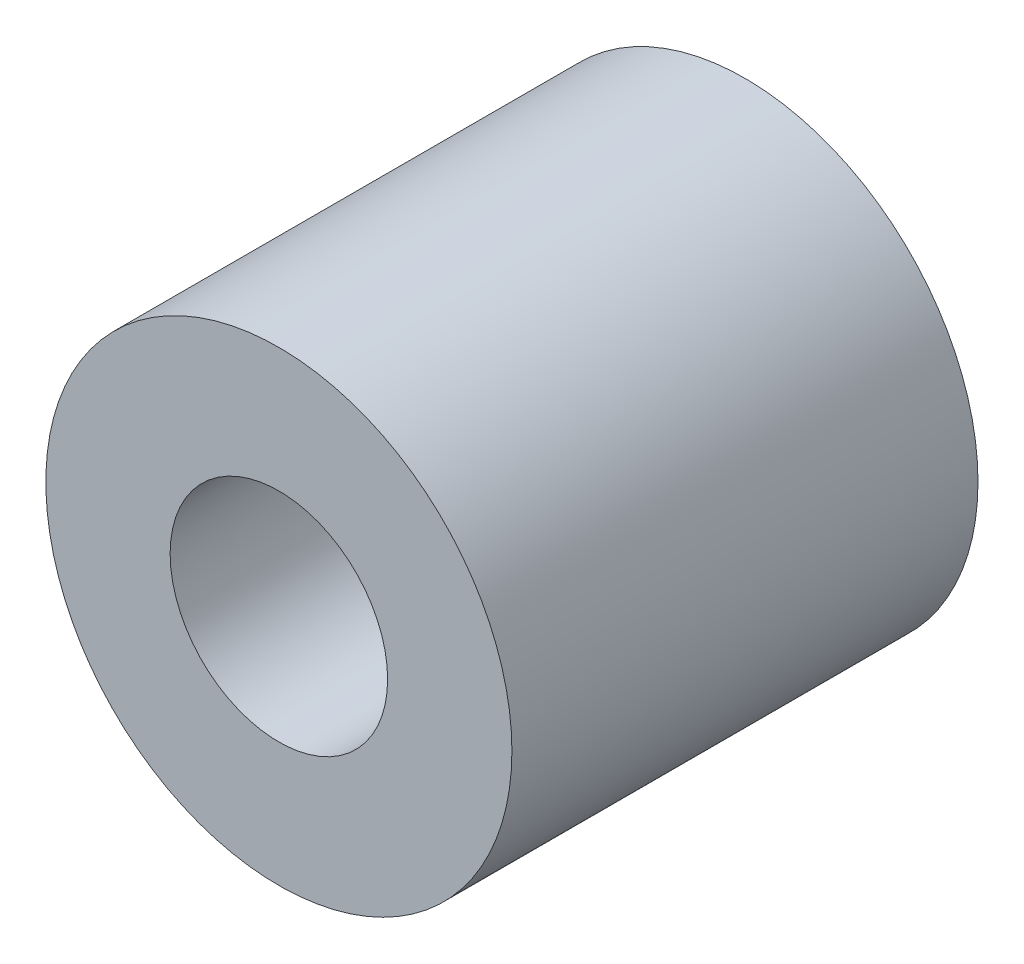
ISO-10303-21;
HEADER;
FILE_DESCRIPTION(('STEP AP214'),'2;1');
FILE_NAME('part.step','',(''),(''),'','','');
FILE_SCHEMA(('AUTOMOTIVE_DESIGN { 1 0 10303 214 1 1 1 1 }'));
ENDSEC;
DATA;
#1=APPLICATION_CONTEXT('core data for automotive mechanical design processes');
#2=APPLICATION_PROTOCOL_DEFINITION('international standard','automotive_design',2000,#1);
#3=PRODUCT_CONTEXT('',#1,'mechanical');
#4=PRODUCT('Part','Part','',(#3));
#5=PRODUCT_RELATED_PRODUCT_CATEGORY('part','',(#4));
#6=PRODUCT_DEFINITION_FORMATION('','',#4);
#7=PRODUCT_DEFINITION_CONTEXT('part definition',#1,'design');
#8=PRODUCT_DEFINITION('design','',#6,#7);
#9=PRODUCT_DEFINITION_SHAPE('','',#8);
#10=(LENGTH_UNIT() NAMED_UNIT(*) SI_UNIT(.MILLI.,.METRE.));
#11=(NAMED_UNIT(*) PLANE_ANGLE_UNIT() SI_UNIT($,.RADIAN.));
#12=(NAMED_UNIT(*) SI_UNIT($,.STERADIAN.) SOLID_ANGLE_UNIT());
#13=UNCERTAINTY_MEASURE_WITH_UNIT(LENGTH_MEASURE(1.E-05),#10,'distance_accuracy_value','');
#14=(GEOMETRIC_REPRESENTATION_CONTEXT(3) GLOBAL_UNCERTAINTY_ASSIGNED_CONTEXT((#13)) GLOBAL_UNIT_ASSIGNED_CONTEXT((#10,
#11,#12)) REPRESENTATION_CONTEXT('',''));
#15=CARTESIAN_POINT('',(0.,0.,0.));
#16=DIRECTION('',(0.,0.,1.));
#17=DIRECTION('',(1.,0.,0.));
#18=AXIS2_PLACEMENT_3D('',#15,#16,#17);
#19=CARTESIAN_POINT('',(-94.9999999999997,-24.9999999999986,-10.0000000000004));
#20=DIRECTION('',(0.,0.,1.));
#21=DIRECTION('',(1.,0.,0.));
#22=AXIS2_PLACEMENT_3D('',#19,#20,#21);
#23=PLANE('',#22);
#24=CARTESIAN_POINT('',(-94.9999999999997,-24.9999999999986,-10.0000000000004));
#25=DIRECTION('',(0.,0.,1.));
#26=DIRECTION('',(1.,0.,0.));
#27=AXIS2_PLACEMENT_3D('',#24,#25,#26);
#28=CIRCLE('',#27,15.);
#29=CARTESIAN_POINT('',(-79.9999999999997,-24.9999999999986,-10.0000000000004));
#30=VERTEX_POINT('',#29);
#31=EDGE_CURVE('E10',#30,#30,#28,.T.);
#32=ORIENTED_EDGE('',*,*,#31,.T.);
#33=EDGE_LOOP('',(#32));
#34=FACE_BOUND('',#33,.T.);
#35=CARTESIAN_POINT('',(-94.9999999999997,-24.9999999999986,-10.0000000000004));
#36=DIRECTION('',(0.,0.,1.));
#37=DIRECTION('',(1.,0.,0.));
#38=AXIS2_PLACEMENT_3D('',#35,#36,#37);
#39=CIRCLE('',#38,7.);
#40=CARTESIAN_POINT('',(-87.9999999999997,-24.9999999999986,-10.0000000000004));
#41=VERTEX_POINT('',#40);
#42=EDGE_CURVE('E43',#41,#41,#39,.T.);
#43=ORIENTED_EDGE('',*,*,#42,.F.);
#44=EDGE_LOOP('',(#43));
#45=FACE_BOUND('',#44,.T.);
#46=ADVANCED_FACE('F32',(#34,#45),#23,.T.);
#47=CARTESIAN_POINT('',(-94.9999999999997,-24.9999999999986,-40.0000000000004));
#48=DIRECTION('',(0.,0.,1.));
#49=DIRECTION('',(1.,0.,0.));
#50=AXIS2_PLACEMENT_3D('',#47,#48,#49);
#51=PLANE('',#50);
#52=CARTESIAN_POINT('',(-94.9999999999997,-24.9999999999986,-40.0000000000004));
#53=DIRECTION('',(0.,0.,1.));
#54=DIRECTION('',(1.,0.,0.));
#55=AXIS2_PLACEMENT_3D('',#52,#53,#54);
#56=CIRCLE('',#55,15.);
#57=CARTESIAN_POINT('',(-79.9999999999997,-24.9999999999986,-40.0000000000004));
#58=VERTEX_POINT('',#57);
#59=EDGE_CURVE('E36',#58,#58,#56,.T.);
#60=ORIENTED_EDGE('',*,*,#59,.F.);
#61=EDGE_LOOP('',(#60));
#62=FACE_BOUND('',#61,.T.);
#63=CARTESIAN_POINT('',(-94.9999999999997,-24.9999999999986,-40.0000000000004));
#64=DIRECTION('',(0.,0.,1.));
#65=DIRECTION('',(1.,0.,0.));
#66=AXIS2_PLACEMENT_3D('',#63,#64,#65);
#67=CIRCLE('',#66,7.);
#68=CARTESIAN_POINT('',(-87.9999999999997,-24.9999999999986,-40.0000000000004));
#69=VERTEX_POINT('',#68);
#70=EDGE_CURVE('E45',#69,#69,#67,.T.);
#71=ORIENTED_EDGE('',*,*,#70,.T.);
#72=EDGE_LOOP('',(#71));
#73=FACE_BOUND('',#72,.T.);
#74=ADVANCED_FACE('F55',(#62,#73),#51,.F.);
#75=CARTESIAN_POINT('',(-94.9999999999997,-24.9999999999986,-10.0000000000004));
#76=DIRECTION('',(0.,0.,-1.));
#77=DIRECTION('',(-1.,0.,0.));
#78=AXIS2_PLACEMENT_3D('',#75,#76,#77);
#79=CYLINDRICAL_SURFACE('',#78,15.);
#80=ORIENTED_EDGE('',*,*,#31,.F.);
#81=EDGE_LOOP('',(#80));
#82=FACE_BOUND('',#81,.T.);
#83=ORIENTED_EDGE('',*,*,#59,.T.);
#84=EDGE_LOOP('',(#83));
#85=FACE_BOUND('',#84,.T.);
#86=ADVANCED_FACE('F34',(#82,#85),#79,.T.);
#87=CARTESIAN_POINT('',(-94.9999999999997,-24.9999999999986,-10.0000000000004));
#88=DIRECTION('',(0.,0.,-1.));
#89=DIRECTION('',(-1.,0.,0.));
#90=AXIS2_PLACEMENT_3D('',#87,#88,#89);
#91=CYLINDRICAL_SURFACE('',#90,7.);
#92=ORIENTED_EDGE('',*,*,#42,.T.);
#93=EDGE_LOOP('',(#92));
#94=FACE_BOUND('',#93,.T.);
#95=ORIENTED_EDGE('',*,*,#70,.F.);
#96=EDGE_LOOP('',(#95));
#97=FACE_BOUND('',#96,.T.);
#98=ADVANCED_FACE('F51',(#94,#97),#91,.F.);
#99=CLOSED_SHELL('',(#46,#74,#86,#98));
#100=MANIFOLD_SOLID_BREP('B2',#99);
#101=ADVANCED_BREP_SHAPE_REPRESENTATION('',(#18,#100),#14);
#102=SHAPE_DEFINITION_REPRESENTATION(#9,#101);
ENDSEC;
END-ISO-10303-21;
